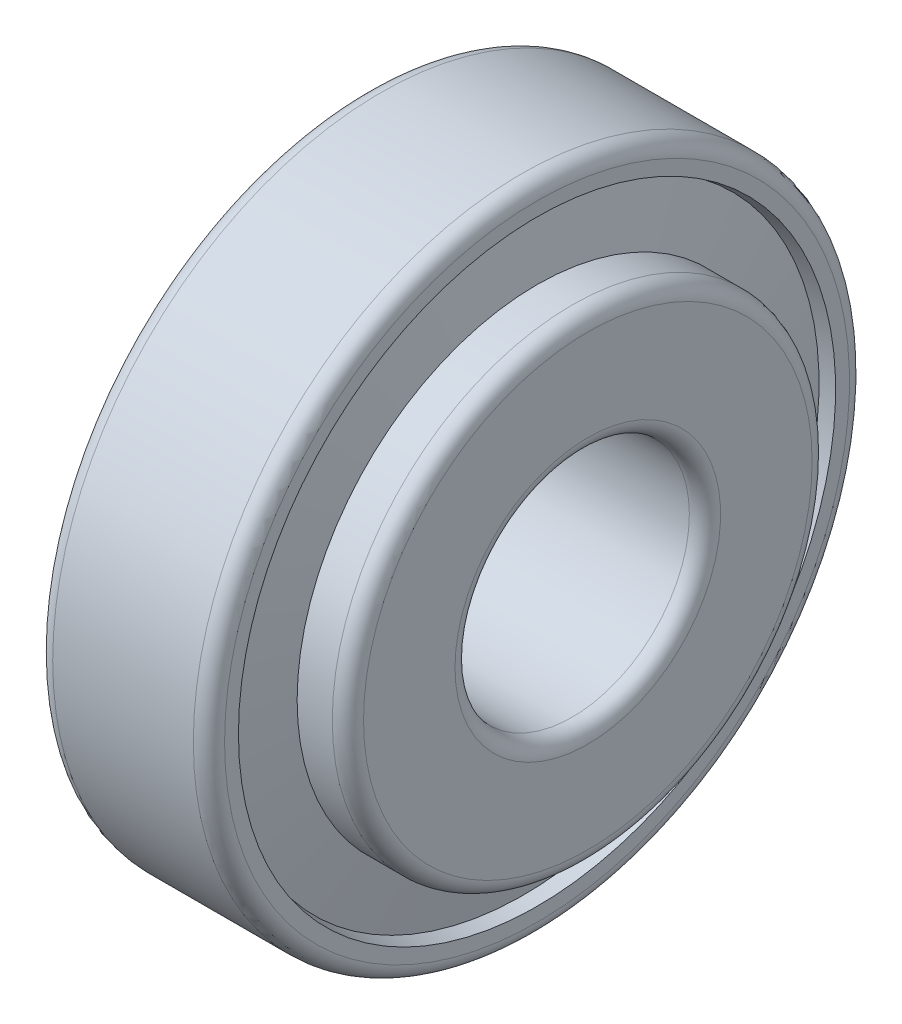
ISO-10303-21;
HEADER;
FILE_DESCRIPTION(('STEP AP214'),'2;1');
FILE_NAME('part.step','',(''),(''),'','','');
FILE_SCHEMA(('AUTOMOTIVE_DESIGN { 1 0 10303 214 1 1 1 1 }'));
ENDSEC;
DATA;
#1=APPLICATION_CONTEXT('core data for automotive mechanical design processes');
#2=APPLICATION_PROTOCOL_DEFINITION('international standard','automotive_design',2000,#1);
#3=PRODUCT_CONTEXT('',#1,'mechanical');
#4=PRODUCT('Part','Part','',(#3));
#5=PRODUCT_RELATED_PRODUCT_CATEGORY('part','',(#4));
#6=PRODUCT_DEFINITION_FORMATION('','',#4);
#7=PRODUCT_DEFINITION_CONTEXT('part definition',#1,'design');
#8=PRODUCT_DEFINITION('design','',#6,#7);
#9=PRODUCT_DEFINITION_SHAPE('','',#8);
#10=(LENGTH_UNIT() NAMED_UNIT(*) SI_UNIT(.MILLI.,.METRE.));
#11=(NAMED_UNIT(*) PLANE_ANGLE_UNIT() SI_UNIT($,.RADIAN.));
#12=(NAMED_UNIT(*) SI_UNIT($,.STERADIAN.) SOLID_ANGLE_UNIT());
#13=UNCERTAINTY_MEASURE_WITH_UNIT(LENGTH_MEASURE(1.E-05),#10,'distance_accuracy_value','');
#14=(GEOMETRIC_REPRESENTATION_CONTEXT(3) GLOBAL_UNCERTAINTY_ASSIGNED_CONTEXT((#13)) GLOBAL_UNIT_ASSIGNED_CONTEXT((#10,
#11,#12)) REPRESENTATION_CONTEXT('',''));
#15=CARTESIAN_POINT('',(0.,0.,0.));
#16=DIRECTION('',(0.,0.,1.));
#17=DIRECTION('',(1.,0.,0.));
#18=AXIS2_PLACEMENT_3D('',#15,#16,#17);
#19=CARTESIAN_POINT('',(2.01221889438929,0.,0.));
#20=DIRECTION('',(-1.,0.,0.));
#21=DIRECTION('',(0.,0.,1.));
#22=AXIS2_PLACEMENT_3D('',#19,#20,#21);
#23=CONICAL_SURFACE('',#22,17.0888729703428,1.383032836238);
#24=CARTESIAN_POINT('',(2.77443778877851,0.,0.));
#25=DIRECTION('',(-1.,0.,0.));
#26=DIRECTION('',(0.,0.,1.));
#27=AXIS2_PLACEMENT_3D('',#24,#25,#26);
#28=CIRCLE('',#27,13.077228356525);
#29=CARTESIAN_POINT('',(2.77443778877851,0.,13.077228356525));
#30=VERTEX_POINT('',#29);
#31=EDGE_CURVE('E112',#30,#30,#28,.T.);
#32=ORIENTED_EDGE('',*,*,#31,.F.);
#33=EDGE_LOOP('',(#32));
#34=FACE_BOUND('',#33,.T.);
#35=CARTESIAN_POINT('',(2.01221889438929,0.,0.));
#36=DIRECTION('',(-1.,0.,0.));
#37=DIRECTION('',(0.,0.,1.));
#38=AXIS2_PLACEMENT_3D('',#35,#36,#37);
#39=CIRCLE('',#38,17.0888729703428);
#40=CARTESIAN_POINT('',(2.01221889438929,0.,17.0888729703428));
#41=VERTEX_POINT('',#40);
#42=EDGE_CURVE('E10',#41,#41,#39,.T.);
#43=ORIENTED_EDGE('',*,*,#42,.T.);
#44=EDGE_LOOP('',(#43));
#45=FACE_BOUND('',#44,.T.);
#46=ADVANCED_FACE('F37',(#34,#45),#23,.F.);
#47=CARTESIAN_POINT('',(0.,0.,0.));
#48=DIRECTION('',(1.,0.,0.));
#49=DIRECTION('',(0.,0.,-1.));
#50=AXIS2_PLACEMENT_3D('',#47,#48,#49);
#51=CONICAL_SURFACE('',#50,16.636,0.221372962857228);
#52=ORIENTED_EDGE('',*,*,#42,.F.);
#53=EDGE_LOOP('',(#52));
#54=FACE_BOUND('',#53,.T.);
#55=CARTESIAN_POINT('',(0.,0.,0.));
#56=DIRECTION('',(-1.,0.,0.));
#57=DIRECTION('',(0.,0.,1.));
#58=AXIS2_PLACEMENT_3D('',#55,#56,#57);
#59=CIRCLE('',#58,16.636);
#60=CARTESIAN_POINT('',(0.,0.,16.636));
#61=VERTEX_POINT('',#60);
#62=EDGE_CURVE('E44',#61,#61,#59,.T.);
#63=ORIENTED_EDGE('',*,*,#62,.T.);
#64=EDGE_LOOP('',(#63));
#65=FACE_BOUND('',#64,.T.);
#66=ADVANCED_FACE('F120',(#54,#65),#51,.F.);
#67=CARTESIAN_POINT('',(0.,16.636,0.));
#68=DIRECTION('',(1.,0.,0.));
#69=DIRECTION('',(0.,0.,-1.));
#70=AXIS2_PLACEMENT_3D('',#67,#68,#69);
#71=PLANE('',#70);
#72=ORIENTED_EDGE('',*,*,#62,.F.);
#73=EDGE_LOOP('',(#72));
#74=FACE_BOUND('',#73,.T.);
#75=CARTESIAN_POINT('',(0.,0.,0.));
#76=DIRECTION('',(-1.,0.,0.));
#77=DIRECTION('',(0.,0.,1.));
#78=AXIS2_PLACEMENT_3D('',#75,#76,#77);
#79=CIRCLE('',#78,20.);
#80=CARTESIAN_POINT('',(0.,0.,20.));
#81=VERTEX_POINT('',#80);
#82=EDGE_CURVE('E49',#81,#81,#79,.T.);
#83=ORIENTED_EDGE('',*,*,#82,.T.);
#84=EDGE_LOOP('',(#83));
#85=FACE_BOUND('',#84,.T.);
#86=ADVANCED_FACE('F124',(#74,#85),#71,.F.);
#87=CARTESIAN_POINT('',(1.,0.,0.));
#88=DIRECTION('',(-1.,0.,0.));
#89=DIRECTION('',(0.,0.,1.));
#90=AXIS2_PLACEMENT_3D('',#87,#88,#89);
#91=TOROIDAL_SURFACE('',#90,20.,1.);
#92=ORIENTED_EDGE('',*,*,#82,.F.);
#93=EDGE_LOOP('',(#92));
#94=FACE_BOUND('',#93,.T.);
#95=CARTESIAN_POINT('',(1.,0.,0.));
#96=DIRECTION('',(-1.,0.,0.));
#97=DIRECTION('',(0.,0.,1.));
#98=AXIS2_PLACEMENT_3D('',#95,#96,#97);
#99=CIRCLE('',#98,21.);
#100=CARTESIAN_POINT('',(1.,0.,21.));
#101=VERTEX_POINT('',#100);
#102=EDGE_CURVE('E54',#101,#101,#99,.T.);
#103=ORIENTED_EDGE('',*,*,#102,.T.);
#104=EDGE_LOOP('',(#103));
#105=FACE_BOUND('',#104,.T.);
#106=ADVANCED_FACE('F129',(#94,#105),#91,.T.);
#107=CARTESIAN_POINT('',(-882.527700014444,0.,0.));
#108=DIRECTION('',(-1.,0.,0.));
#109=DIRECTION('',(0.,0.,1.));
#110=AXIS2_PLACEMENT_3D('',#107,#108,#109);
#111=CYLINDRICAL_SURFACE('',#110,21.);
#112=ORIENTED_EDGE('',*,*,#102,.F.);
#113=EDGE_LOOP('',(#112));
#114=FACE_BOUND('',#113,.T.);
#115=CARTESIAN_POINT('',(10.,0.,0.));
#116=DIRECTION('',(-1.,0.,0.));
#117=DIRECTION('',(0.,0.,1.));
#118=AXIS2_PLACEMENT_3D('',#115,#116,#117);
#119=CIRCLE('',#118,21.);
#120=CARTESIAN_POINT('',(10.,0.,21.));
#121=VERTEX_POINT('',#120);
#122=EDGE_CURVE('E60',#121,#121,#119,.T.);
#123=ORIENTED_EDGE('',*,*,#122,.T.);
#124=EDGE_LOOP('',(#123));
#125=FACE_BOUND('',#124,.T.);
#126=ADVANCED_FACE('F135',(#114,#125),#111,.T.);
#127=CARTESIAN_POINT('',(10.,0.,0.));
#128=DIRECTION('',(-1.,0.,0.));
#129=DIRECTION('',(0.,0.,1.));
#130=AXIS2_PLACEMENT_3D('',#127,#128,#129);
#131=TOROIDAL_SURFACE('',#130,20.,1.);
#132=ORIENTED_EDGE('',*,*,#122,.F.);
#133=EDGE_LOOP('',(#132));
#134=FACE_BOUND('',#133,.T.);
#135=CARTESIAN_POINT('',(11.,0.,0.));
#136=DIRECTION('',(-1.,0.,0.));
#137=DIRECTION('',(0.,0.,1.));
#138=AXIS2_PLACEMENT_3D('',#135,#136,#137);
#139=CIRCLE('',#138,20.);
#140=CARTESIAN_POINT('',(11.,0.,20.));
#141=VERTEX_POINT('',#140);
#142=EDGE_CURVE('E64',#141,#141,#139,.T.);
#143=ORIENTED_EDGE('',*,*,#142,.T.);
#144=EDGE_LOOP('',(#143));
#145=FACE_BOUND('',#144,.T.);
#146=ADVANCED_FACE('F139',(#134,#145),#131,.T.);
#147=CARTESIAN_POINT('',(11.,20.,0.));
#148=DIRECTION('',(-1.,0.,0.));
#149=DIRECTION('',(0.,0.,1.));
#150=AXIS2_PLACEMENT_3D('',#147,#148,#149);
#151=PLANE('',#150);
#152=ORIENTED_EDGE('',*,*,#142,.F.);
#153=EDGE_LOOP('',(#152));
#154=FACE_BOUND('',#153,.T.);
#155=CARTESIAN_POINT('',(11.,0.,0.));
#156=DIRECTION('',(-1.,0.,0.));
#157=DIRECTION('',(0.,0.,1.));
#158=AXIS2_PLACEMENT_3D('',#155,#156,#157);
#159=CIRCLE('',#158,19.1116763231185);
#160=CARTESIAN_POINT('',(11.,0.,19.1116763231185));
#161=VERTEX_POINT('',#160);
#162=EDGE_CURVE('E68',#161,#161,#159,.T.);
#163=ORIENTED_EDGE('',*,*,#162,.T.);
#164=EDGE_LOOP('',(#163));
#165=FACE_BOUND('',#164,.T.);
#166=ADVANCED_FACE('F143',(#154,#165),#151,.F.);
#167=CARTESIAN_POINT('',(10.1333541671212,0.,0.));
#168=DIRECTION('',(1.,0.,0.));
#169=DIRECTION('',(0.,0.,-1.));
#170=AXIS2_PLACEMENT_3D('',#167,#168,#169);
#171=CONICAL_SURFACE('',#170,18.9166277259379,0.22137296285723);
#172=ORIENTED_EDGE('',*,*,#162,.F.);
#173=EDGE_LOOP('',(#172));
#174=FACE_BOUND('',#173,.T.);
#175=CARTESIAN_POINT('',(10.1333541671212,0.,0.));
#176=DIRECTION('',(-1.,0.,0.));
#177=DIRECTION('',(0.,0.,1.));
#178=AXIS2_PLACEMENT_3D('',#175,#176,#177);
#179=CIRCLE('',#178,18.9166277259379);
#180=CARTESIAN_POINT('',(10.1333541671212,0.,18.9166277259379));
#181=VERTEX_POINT('',#180);
#182=EDGE_CURVE('E72',#181,#181,#179,.T.);
#183=ORIENTED_EDGE('',*,*,#182,.T.);
#184=EDGE_LOOP('',(#183));
#185=FACE_BOUND('',#184,.T.);
#186=ADVANCED_FACE('F147',(#174,#185),#171,.F.);
#187=CARTESIAN_POINT('',(11.,0.,0.));
#188=DIRECTION('',(-1.,0.,0.));
#189=DIRECTION('',(0.,0.,1.));
#190=AXIS2_PLACEMENT_3D('',#187,#188,#189);
#191=CONICAL_SURFACE('',#190,14.3553722740621,1.38303283623798);
#192=ORIENTED_EDGE('',*,*,#182,.F.);
#193=EDGE_LOOP('',(#192));
#194=FACE_BOUND('',#193,.T.);
#195=CARTESIAN_POINT('',(11.,0.,0.));
#196=DIRECTION('',(-1.,0.,0.));
#197=DIRECTION('',(0.,0.,1.));
#198=AXIS2_PLACEMENT_3D('',#195,#196,#197);
#199=CIRCLE('',#198,14.3553722740621);
#200=CARTESIAN_POINT('',(11.,0.,14.3553722740621));
#201=VERTEX_POINT('',#200);
#202=EDGE_CURVE('E76',#201,#201,#199,.T.);
#203=ORIENTED_EDGE('',*,*,#202,.T.);
#204=EDGE_LOOP('',(#203));
#205=FACE_BOUND('',#204,.T.);
#206=ADVANCED_FACE('F151',(#194,#205),#191,.T.);
#207=CARTESIAN_POINT('',(11.,15.3553722740621,0.));
#208=DIRECTION('',(1.,0.,0.));
#209=DIRECTION('',(0.,0.,-1.));
#210=AXIS2_PLACEMENT_3D('',#207,#208,#209);
#211=PLANE('',#210);
#212=ORIENTED_EDGE('',*,*,#202,.F.);
#213=EDGE_LOOP('',(#212));
#214=FACE_BOUND('',#213,.T.);
#215=CARTESIAN_POINT('',(11.,0.,0.));
#216=DIRECTION('',(-1.,0.,0.));
#217=DIRECTION('',(0.,0.,1.));
#218=AXIS2_PLACEMENT_3D('',#215,#216,#217);
#219=CIRCLE('',#218,15.3553722740621);
#220=CARTESIAN_POINT('',(11.,0.,15.3553722740621));
#221=VERTEX_POINT('',#220);
#222=EDGE_CURVE('E80',#221,#221,#219,.T.);
#223=ORIENTED_EDGE('',*,*,#222,.T.);
#224=EDGE_LOOP('',(#223));
#225=FACE_BOUND('',#224,.T.);
#226=ADVANCED_FACE('F155',(#214,#225),#211,.F.);
#227=CARTESIAN_POINT('',(-882.527700014444,0.,0.));
#228=DIRECTION('',(-1.,0.,0.));
#229=DIRECTION('',(0.,0.,1.));
#230=AXIS2_PLACEMENT_3D('',#227,#228,#229);
#231=CYLINDRICAL_SURFACE('',#230,15.3553722740621);
#232=ORIENTED_EDGE('',*,*,#222,.F.);
#233=EDGE_LOOP('',(#232));
#234=FACE_BOUND('',#233,.T.);
#235=CARTESIAN_POINT('',(13.25,0.,0.));
#236=DIRECTION('',(-1.,0.,0.));
#237=DIRECTION('',(0.,0.,1.));
#238=AXIS2_PLACEMENT_3D('',#235,#236,#237);
#239=CIRCLE('',#238,15.3553722740621);
#240=CARTESIAN_POINT('',(13.25,0.,15.3553722740621));
#241=VERTEX_POINT('',#240);
#242=EDGE_CURVE('E84',#241,#241,#239,.T.);
#243=ORIENTED_EDGE('',*,*,#242,.T.);
#244=EDGE_LOOP('',(#243));
#245=FACE_BOUND('',#244,.T.);
#246=ADVANCED_FACE('F159',(#234,#245),#231,.T.);
#247=CARTESIAN_POINT('',(13.25,0.,0.));
#248=DIRECTION('',(-1.,0.,0.));
#249=DIRECTION('',(0.,0.,1.));
#250=AXIS2_PLACEMENT_3D('',#247,#248,#249);
#251=TOROIDAL_SURFACE('',#250,14.3553722740621,0.999999999999998);
#252=ORIENTED_EDGE('',*,*,#242,.F.);
#253=EDGE_LOOP('',(#252));
#254=FACE_BOUND('',#253,.T.);
#255=CARTESIAN_POINT('',(14.25,0.,0.));
#256=DIRECTION('',(-1.,0.,0.));
#257=DIRECTION('',(0.,0.,1.));
#258=AXIS2_PLACEMENT_3D('',#255,#256,#257);
#259=CIRCLE('',#258,14.3553722740621);
#260=CARTESIAN_POINT('',(14.25,0.,14.3553722740621));
#261=VERTEX_POINT('',#260);
#262=EDGE_CURVE('E88',#261,#261,#259,.T.);
#263=ORIENTED_EDGE('',*,*,#262,.T.);
#264=EDGE_LOOP('',(#263));
#265=FACE_BOUND('',#264,.T.);
#266=ADVANCED_FACE('F163',(#254,#265),#251,.T.);
#267=CARTESIAN_POINT('',(14.25,8.5,0.));
#268=DIRECTION('',(-1.,0.,0.));
#269=DIRECTION('',(0.,0.,1.));
#270=AXIS2_PLACEMENT_3D('',#267,#268,#269);
#271=PLANE('',#270);
#272=ORIENTED_EDGE('',*,*,#262,.F.);
#273=EDGE_LOOP('',(#272));
#274=FACE_BOUND('',#273,.T.);
#275=CARTESIAN_POINT('',(14.25,0.,0.));
#276=DIRECTION('',(-1.,0.,0.));
#277=DIRECTION('',(0.,0.,1.));
#278=AXIS2_PLACEMENT_3D('',#275,#276,#277);
#279=CIRCLE('',#278,8.5);
#280=CARTESIAN_POINT('',(14.25,0.,8.5));
#281=VERTEX_POINT('',#280);
#282=EDGE_CURVE('E92',#281,#281,#279,.T.);
#283=ORIENTED_EDGE('',*,*,#282,.T.);
#284=EDGE_LOOP('',(#283));
#285=FACE_BOUND('',#284,.T.);
#286=ADVANCED_FACE('F167',(#274,#285),#271,.F.);
#287=CARTESIAN_POINT('',(13.25,0.,0.));
#288=DIRECTION('',(-1.,0.,0.));
#289=DIRECTION('',(0.,0.,1.));
#290=AXIS2_PLACEMENT_3D('',#287,#288,#289);
#291=TOROIDAL_SURFACE('',#290,8.5,0.999999999999999);
#292=ORIENTED_EDGE('',*,*,#282,.F.);
#293=EDGE_LOOP('',(#292));
#294=FACE_BOUND('',#293,.T.);
#295=CARTESIAN_POINT('',(13.25,0.,0.));
#296=DIRECTION('',(-1.,0.,0.));
#297=DIRECTION('',(0.,0.,1.));
#298=AXIS2_PLACEMENT_3D('',#295,#296,#297);
#299=CIRCLE('',#298,7.5);
#300=CARTESIAN_POINT('',(13.25,0.,7.5));
#301=VERTEX_POINT('',#300);
#302=EDGE_CURVE('E96',#301,#301,#299,.T.);
#303=ORIENTED_EDGE('',*,*,#302,.T.);
#304=EDGE_LOOP('',(#303));
#305=FACE_BOUND('',#304,.T.);
#306=ADVANCED_FACE('F171',(#294,#305),#291,.T.);
#307=CARTESIAN_POINT('',(-882.527700014444,0.,0.));
#308=DIRECTION('',(-1.,0.,0.));
#309=DIRECTION('',(0.,0.,1.));
#310=AXIS2_PLACEMENT_3D('',#307,#308,#309);
#311=CYLINDRICAL_SURFACE('',#310,7.5);
#312=ORIENTED_EDGE('',*,*,#302,.F.);
#313=EDGE_LOOP('',(#312));
#314=FACE_BOUND('',#313,.T.);
#315=CARTESIAN_POINT('',(2.24999999999997,0.,0.));
#316=DIRECTION('',(-1.,0.,0.));
#317=DIRECTION('',(0.,0.,1.));
#318=AXIS2_PLACEMENT_3D('',#315,#316,#317);
#319=CIRCLE('',#318,7.5);
#320=CARTESIAN_POINT('',(2.24999999999997,0.,7.5));
#321=VERTEX_POINT('',#320);
#322=EDGE_CURVE('E100',#321,#321,#319,.T.);
#323=ORIENTED_EDGE('',*,*,#322,.T.);
#324=EDGE_LOOP('',(#323));
#325=FACE_BOUND('',#324,.T.);
#326=ADVANCED_FACE('F175',(#314,#325),#311,.F.);
#327=CARTESIAN_POINT('',(2.25,0.,0.));
#328=DIRECTION('',(-1.,0.,0.));
#329=DIRECTION('',(0.,0.,1.));
#330=AXIS2_PLACEMENT_3D('',#327,#328,#329);
#331=TOROIDAL_SURFACE('',#330,8.5,1.);
#332=ORIENTED_EDGE('',*,*,#322,.F.);
#333=EDGE_LOOP('',(#332));
#334=FACE_BOUND('',#333,.T.);
#335=CARTESIAN_POINT('',(1.24999999999997,0.,0.));
#336=DIRECTION('',(-1.,0.,0.));
#337=DIRECTION('',(0.,0.,1.));
#338=AXIS2_PLACEMENT_3D('',#335,#336,#337);
#339=CIRCLE('',#338,8.5);
#340=CARTESIAN_POINT('',(1.24999999999997,0.,8.5));
#341=VERTEX_POINT('',#340);
#342=EDGE_CURVE('E104',#341,#341,#339,.T.);
#343=ORIENTED_EDGE('',*,*,#342,.T.);
#344=EDGE_LOOP('',(#343));
#345=FACE_BOUND('',#344,.T.);
#346=ADVANCED_FACE('F179',(#334,#345),#331,.T.);
#347=CARTESIAN_POINT('',(1.25,13.077228356525,0.));
#348=DIRECTION('',(1.,0.,0.));
#349=DIRECTION('',(0.,0.,-1.));
#350=AXIS2_PLACEMENT_3D('',#347,#348,#349);
#351=PLANE('',#350);
#352=ORIENTED_EDGE('',*,*,#342,.F.);
#353=EDGE_LOOP('',(#352));
#354=FACE_BOUND('',#353,.T.);
#355=CARTESIAN_POINT('',(1.24999999999997,0.,0.));
#356=DIRECTION('',(-1.,0.,0.));
#357=DIRECTION('',(0.,0.,1.));
#358=AXIS2_PLACEMENT_3D('',#355,#356,#357);
#359=CIRCLE('',#358,13.077228356525);
#360=CARTESIAN_POINT('',(1.24999999999997,0.,13.077228356525));
#361=VERTEX_POINT('',#360);
#362=EDGE_CURVE('E108',#361,#361,#359,.T.);
#363=ORIENTED_EDGE('',*,*,#362,.T.);
#364=EDGE_LOOP('',(#363));
#365=FACE_BOUND('',#364,.T.);
#366=ADVANCED_FACE('F183',(#354,#365),#351,.F.);
#367=CARTESIAN_POINT('',(-882.527700014444,0.,0.));
#368=DIRECTION('',(-1.,0.,0.));
#369=DIRECTION('',(0.,0.,1.));
#370=AXIS2_PLACEMENT_3D('',#367,#368,#369);
#371=CYLINDRICAL_SURFACE('',#370,13.077228356525);
#372=ORIENTED_EDGE('',*,*,#362,.F.);
#373=EDGE_LOOP('',(#372));
#374=FACE_BOUND('',#373,.T.);
#375=ORIENTED_EDGE('',*,*,#31,.T.);
#376=EDGE_LOOP('',(#375));
#377=FACE_BOUND('',#376,.T.);
#378=ADVANCED_FACE('F117',(#374,#377),#371,.T.);
#379=CLOSED_SHELL('',(#46,#66,#86,#106,#126,#146,#166,#186,#206,#226,#246,#266,#286,#306,#326,
#346,#366,#378));
#380=MANIFOLD_SOLID_BREP('B2',#379);
#381=ADVANCED_BREP_SHAPE_REPRESENTATION('',(#18,#380),#14);
#382=SHAPE_DEFINITION_REPRESENTATION(#9,#381);
ENDSEC;
END-ISO-10303-21;
